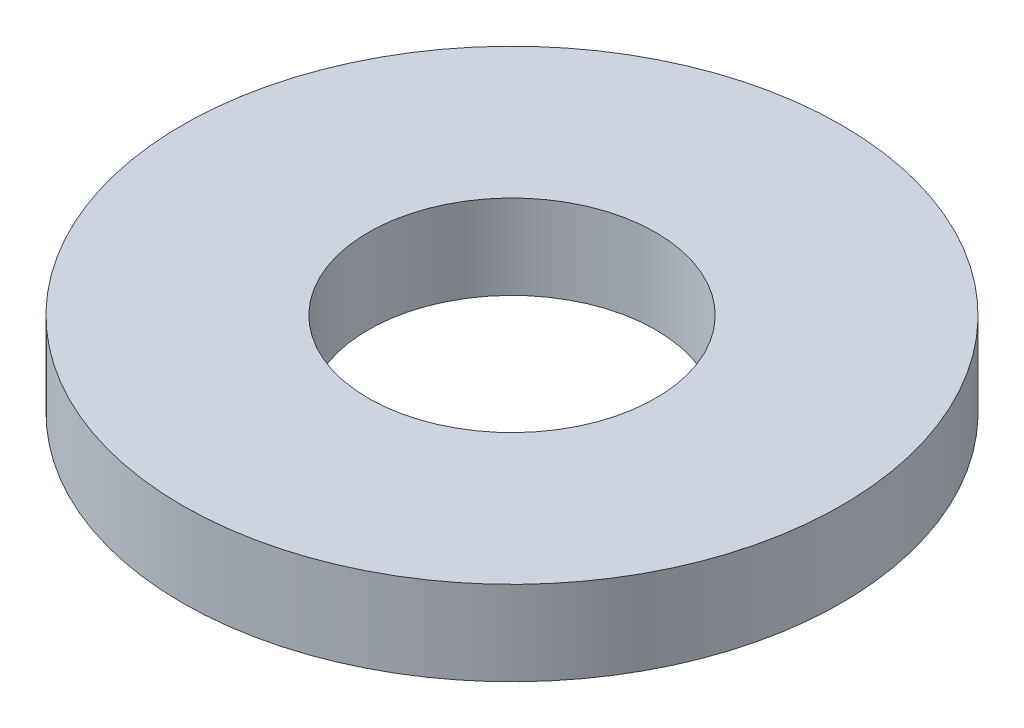
ISO-10303-21;
HEADER;
FILE_DESCRIPTION(('STEP AP214'),'2;1');
FILE_NAME('part.step','',(''),(''),'','','');
FILE_SCHEMA(('AUTOMOTIVE_DESIGN { 1 0 10303 214 1 1 1 1 }'));
ENDSEC;
DATA;
#1=APPLICATION_CONTEXT('core data for automotive mechanical design processes');
#2=APPLICATION_PROTOCOL_DEFINITION('international standard','automotive_design',2000,#1);
#3=PRODUCT_CONTEXT('',#1,'mechanical');
#4=PRODUCT('Part','Part','',(#3));
#5=PRODUCT_RELATED_PRODUCT_CATEGORY('part','',(#4));
#6=PRODUCT_DEFINITION_FORMATION('','',#4);
#7=PRODUCT_DEFINITION_CONTEXT('part definition',#1,'design');
#8=PRODUCT_DEFINITION('design','',#6,#7);
#9=PRODUCT_DEFINITION_SHAPE('','',#8);
#10=(LENGTH_UNIT() NAMED_UNIT(*) SI_UNIT(.MILLI.,.METRE.));
#11=(NAMED_UNIT(*) PLANE_ANGLE_UNIT() SI_UNIT($,.RADIAN.));
#12=(NAMED_UNIT(*) SI_UNIT($,.STERADIAN.) SOLID_ANGLE_UNIT());
#13=UNCERTAINTY_MEASURE_WITH_UNIT(LENGTH_MEASURE(1.E-05),#10,'distance_accuracy_value','');
#14=(GEOMETRIC_REPRESENTATION_CONTEXT(3) GLOBAL_UNCERTAINTY_ASSIGNED_CONTEXT((#13)) GLOBAL_UNIT_ASSIGNED_CONTEXT((#10,
#11,#12)) REPRESENTATION_CONTEXT('',''));
#15=CARTESIAN_POINT('',(0.,0.,0.));
#16=DIRECTION('',(0.,0.,1.));
#17=DIRECTION('',(1.,0.,0.));
#18=AXIS2_PLACEMENT_3D('',#15,#16,#17);
#19=CARTESIAN_POINT('',(0.,0.8128,0.));
#20=DIRECTION('',(0.,-1.,0.));
#21=DIRECTION('',(0.,0.,-1.));
#22=AXIS2_PLACEMENT_3D('',#19,#20,#21);
#23=CYLINDRICAL_SURFACE('',#22,3.175);
#24=CARTESIAN_POINT('',(0.,0.8128,0.));
#25=DIRECTION('',(0.,1.,0.));
#26=DIRECTION('',(0.,0.,1.));
#27=AXIS2_PLACEMENT_3D('',#24,#25,#26);
#28=CIRCLE('',#27,3.175);
#29=CARTESIAN_POINT('',(0.,0.8128,3.175));
#30=VERTEX_POINT('',#29);
#31=EDGE_CURVE('E10',#30,#30,#28,.T.);
#32=ORIENTED_EDGE('',*,*,#31,.F.);
#33=EDGE_LOOP('',(#32));
#34=FACE_BOUND('',#33,.T.);
#35=CARTESIAN_POINT('',(0.,0.,0.));
#36=DIRECTION('',(0.,1.,0.));
#37=DIRECTION('',(0.,0.,1.));
#38=AXIS2_PLACEMENT_3D('',#35,#36,#37);
#39=CIRCLE('',#38,3.175);
#40=CARTESIAN_POINT('',(0.,0.,3.175));
#41=VERTEX_POINT('',#40);
#42=EDGE_CURVE('E33',#41,#41,#39,.T.);
#43=ORIENTED_EDGE('',*,*,#42,.T.);
#44=EDGE_LOOP('',(#43));
#45=FACE_BOUND('',#44,.T.);
#46=ADVANCED_FACE('F30',(#34,#45),#23,.T.);
#47=CARTESIAN_POINT('',(0.,0.8128,0.));
#48=DIRECTION('',(0.,1.,0.));
#49=DIRECTION('',(0.,0.,1.));
#50=AXIS2_PLACEMENT_3D('',#47,#48,#49);
#51=PLANE('',#50);
#52=CARTESIAN_POINT('',(0.,0.8128,0.));
#53=DIRECTION('',(0.,1.,0.));
#54=DIRECTION('',(0.,0.,1.));
#55=AXIS2_PLACEMENT_3D('',#52,#53,#54);
#56=CIRCLE('',#55,1.3843);
#57=CARTESIAN_POINT('',(0.,0.8128,1.3843));
#58=VERTEX_POINT('',#57);
#59=EDGE_CURVE('E42',#58,#58,#56,.T.);
#60=ORIENTED_EDGE('',*,*,#59,.F.);
#61=EDGE_LOOP('',(#60));
#62=FACE_BOUND('',#61,.T.);
#63=ORIENTED_EDGE('',*,*,#31,.T.);
#64=EDGE_LOOP('',(#63));
#65=FACE_BOUND('',#64,.T.);
#66=ADVANCED_FACE('F57',(#62,#65),#51,.T.);
#67=CARTESIAN_POINT('',(0.,0.,0.));
#68=DIRECTION('',(0.,1.,0.));
#69=DIRECTION('',(0.,0.,1.));
#70=AXIS2_PLACEMENT_3D('',#67,#68,#69);
#71=PLANE('',#70);
#72=CARTESIAN_POINT('',(0.,0.,0.));
#73=DIRECTION('',(0.,1.,0.));
#74=DIRECTION('',(0.,0.,1.));
#75=AXIS2_PLACEMENT_3D('',#72,#73,#74);
#76=CIRCLE('',#75,1.3843);
#77=CARTESIAN_POINT('',(0.,0.,1.3843));
#78=VERTEX_POINT('',#77);
#79=EDGE_CURVE('E40',#78,#78,#76,.T.);
#80=ORIENTED_EDGE('',*,*,#79,.T.);
#81=EDGE_LOOP('',(#80));
#82=FACE_BOUND('',#81,.T.);
#83=ORIENTED_EDGE('',*,*,#42,.F.);
#84=EDGE_LOOP('',(#83));
#85=FACE_BOUND('',#84,.T.);
#86=ADVANCED_FACE('F48',(#82,#85),#71,.F.);
#87=CARTESIAN_POINT('',(0.,0.,0.));
#88=DIRECTION('',(0.,1.,0.));
#89=DIRECTION('',(0.,0.,1.));
#90=AXIS2_PLACEMENT_3D('',#87,#88,#89);
#91=CYLINDRICAL_SURFACE('',#90,1.3843);
#92=ORIENTED_EDGE('',*,*,#79,.F.);
#93=EDGE_LOOP('',(#92));
#94=FACE_BOUND('',#93,.T.);
#95=ORIENTED_EDGE('',*,*,#59,.T.);
#96=EDGE_LOOP('',(#95));
#97=FACE_BOUND('',#96,.T.);
#98=ADVANCED_FACE('F51',(#94,#97),#91,.F.);
#99=CLOSED_SHELL('',(#46,#66,#86,#98));
#100=MANIFOLD_SOLID_BREP('B2',#99);
#101=ADVANCED_BREP_SHAPE_REPRESENTATION('',(#18,#100),#14);
#102=SHAPE_DEFINITION_REPRESENTATION(#9,#101);
ENDSEC;
END-ISO-10303-21;
